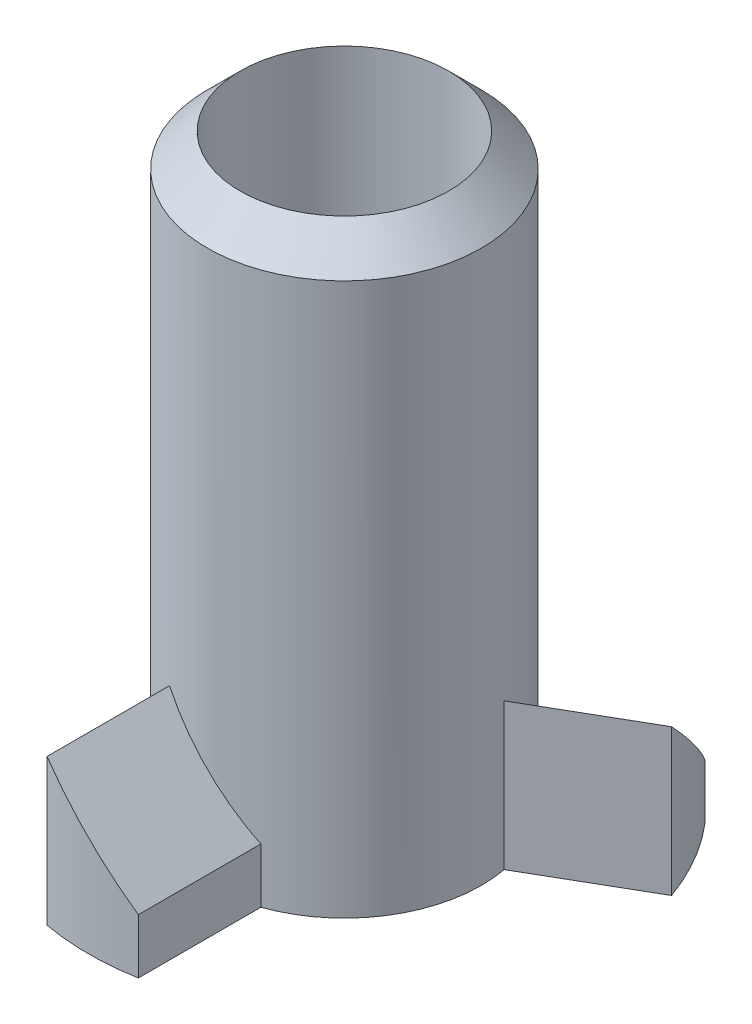
ISO-10303-21;
HEADER;
FILE_DESCRIPTION(('STEP AP214'),'2;1');
FILE_NAME('part.step','',(''),(''),'','','');
FILE_SCHEMA(('AUTOMOTIVE_DESIGN { 1 0 10303 214 1 1 1 1 }'));
ENDSEC;
DATA;
#1=APPLICATION_CONTEXT('core data for automotive mechanical design processes');
#2=APPLICATION_PROTOCOL_DEFINITION('international standard','automotive_design',2000,#1);
#3=PRODUCT_CONTEXT('',#1,'mechanical');
#4=PRODUCT('Part','Part','',(#3));
#5=PRODUCT_RELATED_PRODUCT_CATEGORY('part','',(#4));
#6=PRODUCT_DEFINITION_FORMATION('','',#4);
#7=PRODUCT_DEFINITION_CONTEXT('part definition',#1,'design');
#8=PRODUCT_DEFINITION('design','',#6,#7);
#9=PRODUCT_DEFINITION_SHAPE('','',#8);
#10=(LENGTH_UNIT() NAMED_UNIT(*) SI_UNIT(.MILLI.,.METRE.));
#11=(NAMED_UNIT(*) PLANE_ANGLE_UNIT() SI_UNIT($,.RADIAN.));
#12=(NAMED_UNIT(*) SI_UNIT($,.STERADIAN.) SOLID_ANGLE_UNIT());
#13=UNCERTAINTY_MEASURE_WITH_UNIT(LENGTH_MEASURE(1.E-05),#10,'distance_accuracy_value','');
#14=(GEOMETRIC_REPRESENTATION_CONTEXT(3) GLOBAL_UNCERTAINTY_ASSIGNED_CONTEXT((#13)) GLOBAL_UNIT_ASSIGNED_CONTEXT((#10,
#11,#12)) REPRESENTATION_CONTEXT('',''));
#15=CARTESIAN_POINT('',(0.,0.,0.));
#16=DIRECTION('',(0.,0.,1.));
#17=DIRECTION('',(1.,0.,0.));
#18=AXIS2_PLACEMENT_3D('',#15,#16,#17);
#19=CARTESIAN_POINT('',(0.,2.,0.));
#20=DIRECTION('',(0.,-1.,0.));
#21=DIRECTION('',(0.,0.,-1.));
#22=AXIS2_PLACEMENT_3D('',#19,#20,#21);
#23=CYLINDRICAL_SURFACE('',#22,3.5);
#24=CARTESIAN_POINT('',(0.,1.37500000000001,0.));
#25=DIRECTION('',(0.707106781186544,0.707106781186552,0.));
#26=DIRECTION('',(0.707106781186552,-0.707106781186544,0.));
#27=AXIS2_PLACEMENT_3D('',#24,#25,#26);
#28=ELLIPSE('',#27,4.94974746830581,3.5);
#29=CARTESIAN_POINT('',(-0.625,2.,3.44374432848898));
#30=VERTEX_POINT('',#29);
#31=CARTESIAN_POINT('',(0.625,0.750000000000014,3.44374432848898));
#32=VERTEX_POINT('',#31);
#33=EDGE_CURVE('E74',#30,#32,#28,.T.);
#34=ORIENTED_EDGE('',*,*,#33,.F.);
#35=DIRECTION('',(0.,-1.,0.));
#36=VECTOR('',#35,1.);
#37=CARTESIAN_POINT('',(-0.625,2.,3.44374432848898));
#38=LINE('',#37,#36);
#39=CARTESIAN_POINT('',(-0.625,0.,3.44374432848898));
#40=VERTEX_POINT('',#39);
#41=EDGE_CURVE('E209',#30,#40,#38,.T.);
#42=ORIENTED_EDGE('',*,*,#41,.T.);
#43=CARTESIAN_POINT('',(0.,0.,0.));
#44=DIRECTION('',(0.,1.,0.));
#45=DIRECTION('',(0.,0.,1.));
#46=AXIS2_PLACEMENT_3D('',#43,#44,#45);
#47=CIRCLE('',#46,3.5);
#48=CARTESIAN_POINT('',(0.625,0.,3.44374432848898));
#49=VERTEX_POINT('',#48);
#50=EDGE_CURVE('E207',#40,#49,#47,.T.);
#51=ORIENTED_EDGE('',*,*,#50,.T.);
#52=DIRECTION('',(0.,-1.,0.));
#53=VECTOR('',#52,1.);
#54=CARTESIAN_POINT('',(0.625,2.,3.44374432848898));
#55=LINE('',#54,#53);
#56=EDGE_CURVE('E11',#32,#49,#55,.T.);
#57=ORIENTED_EDGE('',*,*,#56,.F.);
#58=EDGE_LOOP('',(#34,#42,#51,#57));
#59=FACE_BOUND('',#58,.T.);
#60=ADVANCED_FACE('F38',(#59),#23,.T.);
#61=CARTESIAN_POINT('',(0.625,2.,3.44374432848898));
#62=DIRECTION('',(-1.,0.,0.));
#63=DIRECTION('',(0.,0.,1.));
#64=AXIS2_PLACEMENT_3D('',#61,#62,#63);
#65=PLANE('',#64);
#66=DIRECTION('',(0.,0.,-1.));
#67=VECTOR('',#66,1.);
#68=CARTESIAN_POINT('',(0.625,0.750000000000014,3.5));
#69=LINE('',#68,#67);
#70=CARTESIAN_POINT('',(0.625,0.750000000000014,1.76776695296637));
#71=VERTEX_POINT('',#70);
#72=EDGE_CURVE('E202',#32,#71,#69,.T.);
#73=ORIENTED_EDGE('',*,*,#72,.F.);
#74=ORIENTED_EDGE('',*,*,#56,.T.);
#75=DIRECTION('',(0.,0.,-1.));
#76=VECTOR('',#75,1.);
#77=CARTESIAN_POINT('',(0.625,0.,3.44374432848898));
#78=LINE('',#77,#76);
#79=CARTESIAN_POINT('',(0.625,0.,1.76776695296637));
#80=VERTEX_POINT('',#79);
#81=EDGE_CURVE('E213',#49,#80,#78,.T.);
#82=ORIENTED_EDGE('',*,*,#81,.T.);
#83=DIRECTION('',(0.,-1.,0.));
#84=VECTOR('',#83,1.);
#85=CARTESIAN_POINT('',(0.625,2.,1.76776695296637));
#86=LINE('',#85,#84);
#87=EDGE_CURVE('E46',#71,#80,#86,.T.);
#88=ORIENTED_EDGE('',*,*,#87,.F.);
#89=EDGE_LOOP('',(#73,#74,#82,#88));
#90=FACE_BOUND('',#89,.T.);
#91=ADVANCED_FACE('F222',(#90),#65,.F.);
#92=CARTESIAN_POINT('',(-0.625,2.,3.44374432848898));
#93=DIRECTION('',(1.,0.,0.));
#94=DIRECTION('',(0.,0.,-1.));
#95=AXIS2_PLACEMENT_3D('',#92,#93,#94);
#96=PLANE('',#95);
#97=DIRECTION('',(0.,0.,1.));
#98=VECTOR('',#97,1.);
#99=CARTESIAN_POINT('',(-0.625,0.,3.44374432848898));
#100=LINE('',#99,#98);
#101=CARTESIAN_POINT('',(-0.625,0.,1.76776695296637));
#102=VERTEX_POINT('',#101);
#103=EDGE_CURVE('E210',#102,#40,#100,.T.);
#104=ORIENTED_EDGE('',*,*,#103,.T.);
#105=ORIENTED_EDGE('',*,*,#41,.F.);
#106=DIRECTION('',(0.,0.,1.));
#107=VECTOR('',#106,1.);
#108=CARTESIAN_POINT('',(-0.625,2.,3.44374432848898));
#109=LINE('',#108,#107);
#110=CARTESIAN_POINT('',(-0.625,2.,1.76776695296637));
#111=VERTEX_POINT('',#110);
#112=EDGE_CURVE('E70',#111,#30,#109,.T.);
#113=ORIENTED_EDGE('',*,*,#112,.F.);
#114=DIRECTION('',(0.,-1.,0.));
#115=VECTOR('',#114,1.);
#116=CARTESIAN_POINT('',(-0.625,2.,1.76776695296637));
#117=LINE('',#116,#115);
#118=EDGE_CURVE('E53',#111,#102,#117,.T.);
#119=ORIENTED_EDGE('',*,*,#118,.T.);
#120=EDGE_LOOP('',(#104,#105,#113,#119));
#121=FACE_BOUND('',#120,.T.);
#122=ADVANCED_FACE('F224',(#121),#96,.F.);
#123=CARTESIAN_POINT('',(0.,0.,0.));
#124=DIRECTION('',(0.,1.,0.));
#125=DIRECTION('',(0.,0.,1.));
#126=AXIS2_PLACEMENT_3D('',#123,#124,#125);
#127=PLANE('',#126);
#128=ORIENTED_EDGE('',*,*,#50,.F.);
#129=ORIENTED_EDGE('',*,*,#103,.F.);
#130=CARTESIAN_POINT('',(0.,0.,0.));
#131=DIRECTION('',(0.,-1.,0.));
#132=DIRECTION('',(0.,0.,-1.));
#133=AXIS2_PLACEMENT_3D('',#130,#131,#132);
#134=CIRCLE('',#133,1.875);
#135=CARTESIAN_POINT('',(-1.84343108923949,0.,-0.342617599117919));
#136=VERTEX_POINT('',#135);
#137=EDGE_CURVE('E144',#102,#136,#134,.T.);
#138=ORIENTED_EDGE('',*,*,#137,.T.);
#139=DIRECTION('',(0.866025403784436,0.,0.500000000000004));
#140=VECTOR('',#139,1.);
#141=CARTESIAN_POINT('',(-3.29487007261003,0.,-1.18060628687923));
#142=LINE('',#141,#140);
#143=CARTESIAN_POINT('',(-3.29487007261003,0.,-1.18060628687923));
#144=VERTEX_POINT('',#143);
#145=EDGE_CURVE('E189',#144,#136,#142,.T.);
#146=ORIENTED_EDGE('',*,*,#145,.F.);
#147=CARTESIAN_POINT('',(0.,0.,0.));
#148=DIRECTION('',(0.,1.,0.));
#149=DIRECTION('',(-0.866025403784436,0.,-0.500000000000004));
#150=AXIS2_PLACEMENT_3D('',#147,#148,#149);
#151=CIRCLE('',#150,3.5);
#152=CARTESIAN_POINT('',(-2.66987007261003,0.,-2.26313804160978));
#153=VERTEX_POINT('',#152);
#154=EDGE_CURVE('E183',#153,#144,#151,.T.);
#155=ORIENTED_EDGE('',*,*,#154,.F.);
#156=DIRECTION('',(-0.866025403784436,0.,-0.500000000000004));
#157=VECTOR('',#156,1.);
#158=CARTESIAN_POINT('',(-2.66987007261003,0.,-2.26313804160978));
#159=LINE('',#158,#157);
#160=CARTESIAN_POINT('',(-1.21843108923948,0.,-1.42514935384847));
#161=VERTEX_POINT('',#160);
#162=EDGE_CURVE('E142',#161,#153,#159,.T.);
#163=ORIENTED_EDGE('',*,*,#162,.F.);
#164=CARTESIAN_POINT('',(1.2184310892395,0.,-1.42514935384845));
#165=VERTEX_POINT('',#164);
#166=EDGE_CURVE('E132',#161,#165,#134,.T.);
#167=ORIENTED_EDGE('',*,*,#166,.T.);
#168=DIRECTION('',(-0.866025403784443,0.,0.499999999999992));
#169=VECTOR('',#168,1.);
#170=CARTESIAN_POINT('',(2.66987007261006,0.,-2.26313804160974));
#171=LINE('',#170,#169);
#172=CARTESIAN_POINT('',(2.66987007261006,0.,-2.26313804160974));
#173=VERTEX_POINT('',#172);
#174=EDGE_CURVE('E139',#173,#165,#171,.T.);
#175=ORIENTED_EDGE('',*,*,#174,.F.);
#176=CARTESIAN_POINT('',(0.,0.,0.));
#177=DIRECTION('',(0.,1.,0.));
#178=DIRECTION('',(0.866025403784443,0.,-0.499999999999992));
#179=AXIS2_PLACEMENT_3D('',#176,#177,#178);
#180=CIRCLE('',#179,3.5);
#181=CARTESIAN_POINT('',(3.29487007261005,0.,-1.18060628687918));
#182=VERTEX_POINT('',#181);
#183=EDGE_CURVE('E161',#182,#173,#180,.T.);
#184=ORIENTED_EDGE('',*,*,#183,.F.);
#185=DIRECTION('',(0.866025403784443,0.,-0.499999999999992));
#186=VECTOR('',#185,1.);
#187=CARTESIAN_POINT('',(3.29487007261005,0.,-1.18060628687918));
#188=LINE('',#187,#186);
#189=CARTESIAN_POINT('',(1.84343108923949,0.,-0.342617599117893));
#190=VERTEX_POINT('',#189);
#191=EDGE_CURVE('E160',#190,#182,#188,.T.);
#192=ORIENTED_EDGE('',*,*,#191,.F.);
#193=EDGE_CURVE('E146',#190,#80,#134,.T.);
#194=ORIENTED_EDGE('',*,*,#193,.T.);
#195=ORIENTED_EDGE('',*,*,#81,.F.);
#196=EDGE_LOOP('',(#128,#129,#138,#146,#155,#163,#167,#175,#184,#192,#194,#195));
#197=FACE_BOUND('',#196,.T.);
#198=CARTESIAN_POINT('',(0.,0.,0.));
#199=DIRECTION('',(0.,-1.,0.));
#200=DIRECTION('',(0.,0.,-1.));
#201=AXIS2_PLACEMENT_3D('',#198,#199,#200);
#202=CIRCLE('',#201,1.425);
#203=CARTESIAN_POINT('',(0.,0.,-1.425));
#204=VERTEX_POINT('',#203);
#205=EDGE_CURVE('E284',#204,#204,#202,.T.);
#206=ORIENTED_EDGE('',*,*,#205,.F.);
#207=EDGE_LOOP('',(#206));
#208=FACE_BOUND('',#207,.T.);
#209=ADVANCED_FACE('F135',(#197,#208),#127,.F.);
#210=CARTESIAN_POINT('',(-0.625,2.,3.5));
#211=DIRECTION('',(0.707106781186544,0.707106781186552,0.));
#212=DIRECTION('',(-0.707106781186552,0.707106781186544,0.));
#213=AXIS2_PLACEMENT_3D('',#210,#211,#212);
#214=PLANE('',#213);
#215=ORIENTED_EDGE('',*,*,#33,.T.);
#216=ORIENTED_EDGE('',*,*,#72,.T.);
#217=CARTESIAN_POINT('',(0.,1.37500000000001,0.));
#218=DIRECTION('',(0.707106781186544,0.707106781186552,0.));
#219=DIRECTION('',(0.707106781186552,-0.707106781186544,0.));
#220=AXIS2_PLACEMENT_3D('',#217,#218,#219);
#221=ELLIPSE('',#220,2.65165042944954,1.875);
#222=EDGE_CURVE('E204',#71,#111,#221,.F.);
#223=ORIENTED_EDGE('',*,*,#222,.T.);
#224=ORIENTED_EDGE('',*,*,#112,.T.);
#225=EDGE_LOOP('',(#215,#216,#223,#224));
#226=FACE_BOUND('',#225,.T.);
#227=ADVANCED_FACE('F234',(#226),#214,.T.);
#228=CARTESIAN_POINT('',(0.,0.,0.));
#229=DIRECTION('',(0.,-1.,0.));
#230=DIRECTION('',(0.,0.,-1.));
#231=AXIS2_PLACEMENT_3D('',#228,#229,#230);
#232=CYLINDRICAL_SURFACE('',#231,1.875);
#233=CARTESIAN_POINT('',(0.,7.55,0.));
#234=DIRECTION('',(0.,-1.,0.));
#235=DIRECTION('',(0.,0.,-1.));
#236=AXIS2_PLACEMENT_3D('',#233,#234,#235);
#237=CIRCLE('',#236,1.875);
#238=CARTESIAN_POINT('',(0.,7.55,-1.875));
#239=VERTEX_POINT('',#238);
#240=EDGE_CURVE('E221',#239,#239,#237,.T.);
#241=ORIENTED_EDGE('',*,*,#240,.T.);
#242=EDGE_LOOP('',(#241));
#243=FACE_BOUND('',#242,.T.);
#244=ORIENTED_EDGE('',*,*,#87,.T.);
#245=ORIENTED_EDGE('',*,*,#193,.F.);
#246=DIRECTION('',(0.,-1.,0.));
#247=VECTOR('',#246,1.);
#248=CARTESIAN_POINT('',(1.84343108923949,2.,-0.342617599117893));
#249=LINE('',#248,#247);
#250=CARTESIAN_POINT('',(1.84343108923949,2.,-0.342617599117893));
#251=VERTEX_POINT('',#250);
#252=EDGE_CURVE('E156',#251,#190,#249,.T.);
#253=ORIENTED_EDGE('',*,*,#252,.F.);
#254=CARTESIAN_POINT('',(0.,1.37500000000001,0.));
#255=DIRECTION('',(-0.353553390593266,0.707106781186552,-0.612372435695794));
#256=DIRECTION('',(-0.35355339059327,-0.707106781186544,-0.612372435695801));
#257=AXIS2_PLACEMENT_3D('',#254,#255,#256);
#258=ELLIPSE('',#257,2.65165042944954,1.875);
#259=CARTESIAN_POINT('',(1.2184310892395,0.750000000000014,-1.42514935384845));
#260=VERTEX_POINT('',#259);
#261=EDGE_CURVE('E151',#260,#251,#258,.F.);
#262=ORIENTED_EDGE('',*,*,#261,.F.);
#263=DIRECTION('',(0.,-1.,0.));
#264=VECTOR('',#263,1.);
#265=CARTESIAN_POINT('',(1.2184310892395,2.,-1.42514935384845));
#266=LINE('',#265,#264);
#267=EDGE_CURVE('E148',#260,#165,#266,.T.);
#268=ORIENTED_EDGE('',*,*,#267,.T.);
#269=ORIENTED_EDGE('',*,*,#166,.F.);
#270=DIRECTION('',(0.,-1.,0.));
#271=VECTOR('',#270,1.);
#272=CARTESIAN_POINT('',(-1.21843108923948,2.,-1.42514935384846));
#273=LINE('',#272,#271);
#274=CARTESIAN_POINT('',(-1.21843108923948,2.,-1.42514935384846));
#275=VERTEX_POINT('',#274);
#276=EDGE_CURVE('E195',#275,#161,#273,.T.);
#277=ORIENTED_EDGE('',*,*,#276,.F.);
#278=CARTESIAN_POINT('',(0.,1.37500000000001,0.));
#279=DIRECTION('',(-0.353553390593275,0.707106781186552,0.61237243569579));
#280=DIRECTION('',(-0.353553390593279,-0.707106781186544,0.612372435695796));
#281=AXIS2_PLACEMENT_3D('',#278,#279,#280);
#282=ELLIPSE('',#281,2.65165042944954,1.875);
#283=CARTESIAN_POINT('',(-1.84343108923948,0.750000000000014,-0.342617599117918));
#284=VERTEX_POINT('',#283);
#285=EDGE_CURVE('E178',#284,#275,#282,.F.);
#286=ORIENTED_EDGE('',*,*,#285,.F.);
#287=DIRECTION('',(0.,-1.,0.));
#288=VECTOR('',#287,1.);
#289=CARTESIAN_POINT('',(-1.84343108923948,2.,-0.342617599117919));
#290=LINE('',#289,#288);
#291=EDGE_CURVE('E197',#284,#136,#290,.T.);
#292=ORIENTED_EDGE('',*,*,#291,.T.);
#293=ORIENTED_EDGE('',*,*,#137,.F.);
#294=ORIENTED_EDGE('',*,*,#118,.F.);
#295=ORIENTED_EDGE('',*,*,#222,.F.);
#296=EDGE_LOOP('',(#244,#245,#253,#262,#268,#269,#277,#286,#292,#293,#294,#295));
#297=FACE_BOUND('',#296,.T.);
#298=ADVANCED_FACE('F149',(#243,#297),#232,.T.);
#299=CARTESIAN_POINT('',(0.,2.,0.));
#300=DIRECTION('',(0.,-1.,0.));
#301=DIRECTION('',(0.866025403784436,0.,0.500000000000004));
#302=AXIS2_PLACEMENT_3D('',#299,#300,#301);
#303=CYLINDRICAL_SURFACE('',#302,3.5);
#304=CARTESIAN_POINT('',(0.,1.37500000000001,0.));
#305=DIRECTION('',(-0.353553390593275,0.707106781186552,0.61237243569579));
#306=DIRECTION('',(-0.353553390593279,-0.707106781186544,0.612372435695796));
#307=AXIS2_PLACEMENT_3D('',#304,#305,#306);
#308=ELLIPSE('',#307,4.94974746830581,3.5);
#309=CARTESIAN_POINT('',(-2.66987007261003,2.,-2.26313804160978));
#310=VERTEX_POINT('',#309);
#311=CARTESIAN_POINT('',(-3.29487007261003,0.750000000000014,-1.18060628687923));
#312=VERTEX_POINT('',#311);
#313=EDGE_CURVE('E181',#310,#312,#308,.T.);
#314=ORIENTED_EDGE('',*,*,#313,.F.);
#315=DIRECTION('',(0.,-1.,0.));
#316=VECTOR('',#315,1.);
#317=CARTESIAN_POINT('',(-2.66987007261003,2.,-2.26313804160978));
#318=LINE('',#317,#316);
#319=EDGE_CURVE('E186',#310,#153,#318,.T.);
#320=ORIENTED_EDGE('',*,*,#319,.T.);
#321=ORIENTED_EDGE('',*,*,#154,.T.);
#322=DIRECTION('',(0.,-1.,0.));
#323=VECTOR('',#322,1.);
#324=CARTESIAN_POINT('',(-3.29487007261003,2.,-1.18060628687923));
#325=LINE('',#324,#323);
#326=EDGE_CURVE('E200',#312,#144,#325,.T.);
#327=ORIENTED_EDGE('',*,*,#326,.F.);
#328=EDGE_LOOP('',(#314,#320,#321,#327));
#329=FACE_BOUND('',#328,.T.);
#330=ADVANCED_FACE('F237',(#329),#303,.T.);
#331=CARTESIAN_POINT('',(-3.29487007261003,2.,-1.18060628687923));
#332=DIRECTION('',(0.500000000000004,0.,-0.866025403784436));
#333=DIRECTION('',(-0.866025403784436,0.,-0.500000000000004));
#334=AXIS2_PLACEMENT_3D('',#331,#332,#333);
#335=PLANE('',#334);
#336=DIRECTION('',(0.866025403784436,0.,0.500000000000004));
#337=VECTOR('',#336,1.);
#338=CARTESIAN_POINT('',(-3.34358891324553,0.750000000000014,-1.20873412263474));
#339=LINE('',#338,#337);
#340=EDGE_CURVE('E175',#312,#284,#339,.T.);
#341=ORIENTED_EDGE('',*,*,#340,.F.);
#342=ORIENTED_EDGE('',*,*,#326,.T.);
#343=ORIENTED_EDGE('',*,*,#145,.T.);
#344=ORIENTED_EDGE('',*,*,#291,.F.);
#345=EDGE_LOOP('',(#341,#342,#343,#344));
#346=FACE_BOUND('',#345,.T.);
#347=ADVANCED_FACE('F240',(#346),#335,.F.);
#348=CARTESIAN_POINT('',(-2.66987007261003,2.,-2.26313804160978));
#349=DIRECTION('',(-0.500000000000004,0.,0.866025403784436));
#350=DIRECTION('',(0.866025403784436,0.,0.500000000000004));
#351=AXIS2_PLACEMENT_3D('',#348,#349,#350);
#352=PLANE('',#351);
#353=ORIENTED_EDGE('',*,*,#162,.T.);
#354=ORIENTED_EDGE('',*,*,#319,.F.);
#355=DIRECTION('',(-0.866025403784436,0.,-0.500000000000004));
#356=VECTOR('',#355,1.);
#357=CARTESIAN_POINT('',(-2.66987007261003,2.,-2.26313804160978));
#358=LINE('',#357,#356);
#359=EDGE_CURVE('E184',#275,#310,#358,.T.);
#360=ORIENTED_EDGE('',*,*,#359,.F.);
#361=ORIENTED_EDGE('',*,*,#276,.T.);
#362=EDGE_LOOP('',(#353,#354,#360,#361));
#363=FACE_BOUND('',#362,.T.);
#364=ADVANCED_FACE('F244',(#363),#352,.F.);
#365=CARTESIAN_POINT('',(-2.71858891324553,2.,-2.29126587736529));
#366=DIRECTION('',(-0.353553390593275,0.707106781186552,0.61237243569579));
#367=DIRECTION('',(0.353553390593279,0.707106781186544,-0.612372435695796));
#368=AXIS2_PLACEMENT_3D('',#365,#366,#367);
#369=PLANE('',#368);
#370=ORIENTED_EDGE('',*,*,#313,.T.);
#371=ORIENTED_EDGE('',*,*,#340,.T.);
#372=ORIENTED_EDGE('',*,*,#285,.T.);
#373=ORIENTED_EDGE('',*,*,#359,.T.);
#374=EDGE_LOOP('',(#370,#371,#372,#373));
#375=FACE_BOUND('',#374,.T.);
#376=ADVANCED_FACE('F248',(#375),#369,.T.);
#377=CARTESIAN_POINT('',(0.,2.,0.));
#378=DIRECTION('',(0.,-1.,0.));
#379=DIRECTION('',(-0.866025403784443,0.,0.499999999999992));
#380=AXIS2_PLACEMENT_3D('',#377,#378,#379);
#381=CYLINDRICAL_SURFACE('',#380,3.5);
#382=CARTESIAN_POINT('',(0.,1.37500000000001,0.));
#383=DIRECTION('',(-0.353553390593266,0.707106781186552,-0.612372435695794));
#384=DIRECTION('',(-0.35355339059327,-0.707106781186544,-0.612372435695801));
#385=AXIS2_PLACEMENT_3D('',#382,#383,#384);
#386=ELLIPSE('',#385,4.94974746830581,3.5);
#387=CARTESIAN_POINT('',(3.29487007261005,2.,-1.18060628687918));
#388=VERTEX_POINT('',#387);
#389=CARTESIAN_POINT('',(2.66987007261006,0.750000000000014,-2.26313804160974));
#390=VERTEX_POINT('',#389);
#391=EDGE_CURVE('E165',#388,#390,#386,.T.);
#392=ORIENTED_EDGE('',*,*,#391,.F.);
#393=DIRECTION('',(0.,-1.,0.));
#394=VECTOR('',#393,1.);
#395=CARTESIAN_POINT('',(3.29487007261005,2.,-1.18060628687918));
#396=LINE('',#395,#394);
#397=EDGE_CURVE('E169',#388,#182,#396,.T.);
#398=ORIENTED_EDGE('',*,*,#397,.T.);
#399=ORIENTED_EDGE('',*,*,#183,.T.);
#400=DIRECTION('',(0.,-1.,0.));
#401=VECTOR('',#400,1.);
#402=CARTESIAN_POINT('',(2.66987007261006,2.,-2.26313804160974));
#403=LINE('',#402,#401);
#404=EDGE_CURVE('E155',#390,#173,#403,.T.);
#405=ORIENTED_EDGE('',*,*,#404,.F.);
#406=EDGE_LOOP('',(#392,#398,#399,#405));
#407=FACE_BOUND('',#406,.T.);
#408=ADVANCED_FACE('F252',(#407),#381,.T.);
#409=CARTESIAN_POINT('',(2.66987007261006,2.,-2.26313804160974));
#410=DIRECTION('',(0.499999999999992,0.,0.866025403784443));
#411=DIRECTION('',(0.866025403784443,0.,-0.499999999999992));
#412=AXIS2_PLACEMENT_3D('',#409,#410,#411);
#413=PLANE('',#412);
#414=DIRECTION('',(-0.866025403784443,0.,0.499999999999992));
#415=VECTOR('',#414,1.);
#416=CARTESIAN_POINT('',(2.71858891324556,0.750000000000014,-2.29126587736525));
#417=LINE('',#416,#415);
#418=EDGE_CURVE('E289',#390,#260,#417,.T.);
#419=ORIENTED_EDGE('',*,*,#418,.F.);
#420=ORIENTED_EDGE('',*,*,#404,.T.);
#421=ORIENTED_EDGE('',*,*,#174,.T.);
#422=ORIENTED_EDGE('',*,*,#267,.F.);
#423=EDGE_LOOP('',(#419,#420,#421,#422));
#424=FACE_BOUND('',#423,.T.);
#425=ADVANCED_FACE('F158',(#424),#413,.F.);
#426=CARTESIAN_POINT('',(3.29487007261005,2.,-1.18060628687918));
#427=DIRECTION('',(-0.499999999999992,0.,-0.866025403784443));
#428=DIRECTION('',(-0.866025403784443,0.,0.499999999999992));
#429=AXIS2_PLACEMENT_3D('',#426,#427,#428);
#430=PLANE('',#429);
#431=ORIENTED_EDGE('',*,*,#191,.T.);
#432=ORIENTED_EDGE('',*,*,#397,.F.);
#433=DIRECTION('',(0.866025403784443,0.,-0.499999999999992));
#434=VECTOR('',#433,1.);
#435=CARTESIAN_POINT('',(3.29487007261005,2.,-1.18060628687918));
#436=LINE('',#435,#434);
#437=EDGE_CURVE('E163',#251,#388,#436,.T.);
#438=ORIENTED_EDGE('',*,*,#437,.F.);
#439=ORIENTED_EDGE('',*,*,#252,.T.);
#440=EDGE_LOOP('',(#431,#432,#438,#439));
#441=FACE_BOUND('',#440,.T.);
#442=ADVANCED_FACE('F259',(#441),#430,.F.);
#443=CARTESIAN_POINT('',(3.34358891324555,2.,-1.20873412263469));
#444=DIRECTION('',(-0.353553390593266,0.707106781186552,-0.612372435695794));
#445=DIRECTION('',(0.35355339059327,0.707106781186544,0.612372435695801));
#446=AXIS2_PLACEMENT_3D('',#443,#444,#445);
#447=PLANE('',#446);
#448=ORIENTED_EDGE('',*,*,#391,.T.);
#449=ORIENTED_EDGE('',*,*,#418,.T.);
#450=ORIENTED_EDGE('',*,*,#261,.T.);
#451=ORIENTED_EDGE('',*,*,#437,.T.);
#452=EDGE_LOOP('',(#448,#449,#450,#451));
#453=FACE_BOUND('',#452,.T.);
#454=ADVANCED_FACE('F262',(#453),#447,.T.);
#455=CARTESIAN_POINT('',(0.,0.,0.));
#456=DIRECTION('',(0.,-1.,0.));
#457=DIRECTION('',(0.,0.,-1.));
#458=AXIS2_PLACEMENT_3D('',#455,#456,#457);
#459=CYLINDRICAL_SURFACE('',#458,1.425);
#460=ORIENTED_EDGE('',*,*,#205,.T.);
#461=EDGE_LOOP('',(#460));
#462=FACE_BOUND('',#461,.T.);
#463=CARTESIAN_POINT('',(0.,8.,0.));
#464=DIRECTION('',(0.,-1.,0.));
#465=DIRECTION('',(0.,0.,-1.));
#466=AXIS2_PLACEMENT_3D('',#463,#464,#465);
#467=CIRCLE('',#466,1.425);
#468=CARTESIAN_POINT('',(0.,8.,-1.425));
#469=VERTEX_POINT('',#468);
#470=EDGE_CURVE('E281',#469,#469,#467,.T.);
#471=ORIENTED_EDGE('',*,*,#470,.F.);
#472=EDGE_LOOP('',(#471));
#473=FACE_BOUND('',#472,.T.);
#474=ADVANCED_FACE('F266',(#462,#473),#459,.F.);
#475=CARTESIAN_POINT('',(0.,7.55,0.));
#476=DIRECTION('',(0.,-1.,0.));
#477=DIRECTION('',(0.,0.,-1.));
#478=AXIS2_PLACEMENT_3D('',#475,#476,#477);
#479=CONICAL_SURFACE('',#478,1.875,0.785398163397444);
#480=ORIENTED_EDGE('',*,*,#470,.T.);
#481=EDGE_LOOP('',(#480));
#482=FACE_BOUND('',#481,.T.);
#483=ORIENTED_EDGE('',*,*,#240,.F.);
#484=EDGE_LOOP('',(#483));
#485=FACE_BOUND('',#484,.T.);
#486=ADVANCED_FACE('F270',(#482,#485),#479,.T.);
#487=CLOSED_SHELL('',(#60,#91,#122,#209,#227,#298,#330,#347,#364,#376,#408,#425,#442,#454,#474,#486));
#488=MANIFOLD_SOLID_BREP('B2',#487);
#489=ADVANCED_BREP_SHAPE_REPRESENTATION('',(#18,#488),#14);
#490=SHAPE_DEFINITION_REPRESENTATION(#9,#489);
ENDSEC;
END-ISO-10303-21;
